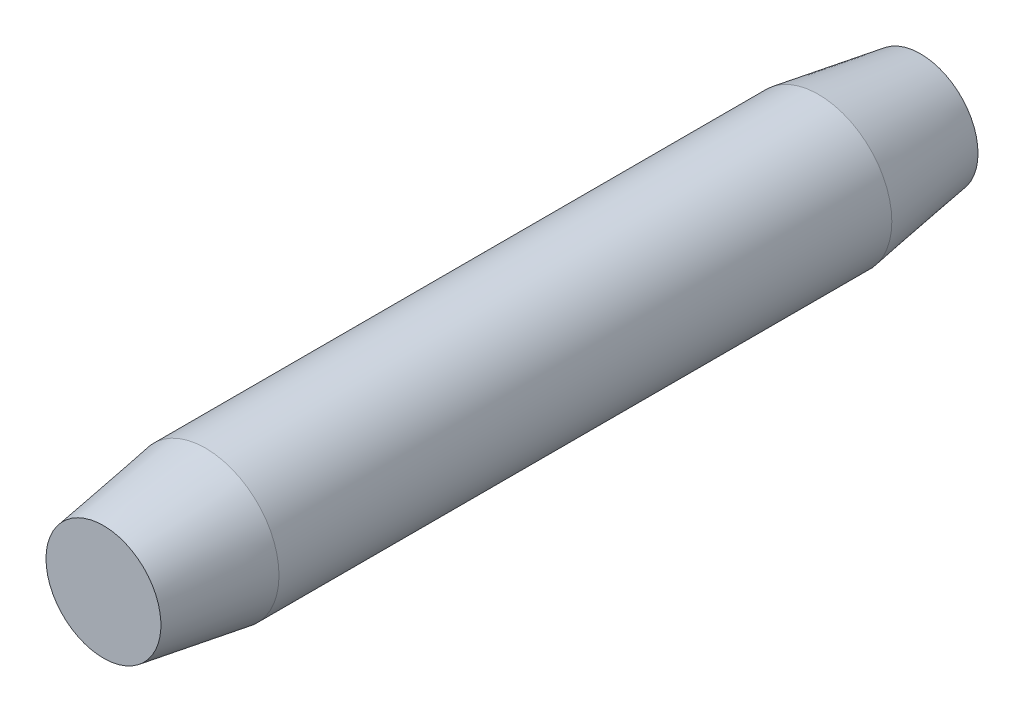
ISO-10303-21;
HEADER;
FILE_DESCRIPTION(('STEP AP214'),'2;1');
FILE_NAME('part.step','',(''),(''),'','','');
FILE_SCHEMA(('AUTOMOTIVE_DESIGN { 1 0 10303 214 1 1 1 1 }'));
ENDSEC;
DATA;
#1=APPLICATION_CONTEXT('core data for automotive mechanical design processes');
#2=APPLICATION_PROTOCOL_DEFINITION('international standard','automotive_design',2000,#1);
#3=PRODUCT_CONTEXT('',#1,'mechanical');
#4=PRODUCT('Part','Part','',(#3));
#5=PRODUCT_RELATED_PRODUCT_CATEGORY('part','',(#4));
#6=PRODUCT_DEFINITION_FORMATION('','',#4);
#7=PRODUCT_DEFINITION_CONTEXT('part definition',#1,'design');
#8=PRODUCT_DEFINITION('design','',#6,#7);
#9=PRODUCT_DEFINITION_SHAPE('','',#8);
#10=(LENGTH_UNIT() NAMED_UNIT(*) SI_UNIT(.MILLI.,.METRE.));
#11=(NAMED_UNIT(*) PLANE_ANGLE_UNIT() SI_UNIT($,.RADIAN.));
#12=(NAMED_UNIT(*) SI_UNIT($,.STERADIAN.) SOLID_ANGLE_UNIT());
#13=UNCERTAINTY_MEASURE_WITH_UNIT(LENGTH_MEASURE(1.E-05),#10,'distance_accuracy_value','');
#14=(GEOMETRIC_REPRESENTATION_CONTEXT(3) GLOBAL_UNCERTAINTY_ASSIGNED_CONTEXT((#13)) GLOBAL_UNIT_ASSIGNED_CONTEXT((#10,
#11,#12)) REPRESENTATION_CONTEXT('',''));
#15=CARTESIAN_POINT('',(0.,0.,0.));
#16=DIRECTION('',(0.,0.,1.));
#17=DIRECTION('',(1.,0.,0.));
#18=AXIS2_PLACEMENT_3D('',#15,#16,#17);
#19=CARTESIAN_POINT('',(-4.83870960531696,12.5960053959194,203.2));
#20=DIRECTION('',(0.,0.,-1.));
#21=DIRECTION('',(-1.,0.,0.));
#22=AXIS2_PLACEMENT_3D('',#19,#20,#21);
#23=PLANE('',#22);
#24=CARTESIAN_POINT('',(-4.83870960531696,12.5960053959194,203.199999999998));
#25=DIRECTION('',(0.,0.,-1.));
#26=DIRECTION('',(-1.,0.,0.));
#27=AXIS2_PLACEMENT_3D('',#24,#25,#26);
#28=CIRCLE('',#27,14.2874999999872);
#29=CARTESIAN_POINT('',(-19.1262096053042,12.5960053959194,203.199999999998));
#30=VERTEX_POINT('',#29);
#31=EDGE_CURVE('E18',#30,#30,#28,.T.);
#32=ORIENTED_EDGE('',*,*,#31,.F.);
#33=EDGE_LOOP('',(#32));
#34=FACE_BOUND('',#33,.T.);
#35=ADVANCED_FACE('F15',(#34),#23,.F.);
#36=CARTESIAN_POINT('',(-4.83870960531696,12.5960053959194,0.));
#37=DIRECTION('',(0.,0.,-1.));
#38=DIRECTION('',(-1.,0.,0.));
#39=AXIS2_PLACEMENT_3D('',#36,#37,#38);
#40=PLANE('',#39);
#41=CARTESIAN_POINT('',(-4.83870960531696,12.5960053959194,2.00880978518114E-12));
#42=DIRECTION('',(0.,0.,1.));
#43=DIRECTION('',(1.,0.,0.));
#44=AXIS2_PLACEMENT_3D('',#41,#42,#43);
#45=CIRCLE('',#44,14.2874999999872);
#46=CARTESIAN_POINT('',(9.44879039467024,12.5960053959194,2.00880978518114E-12));
#47=VERTEX_POINT('',#46);
#48=EDGE_CURVE('E27',#47,#47,#45,.T.);
#49=ORIENTED_EDGE('',*,*,#48,.F.);
#50=EDGE_LOOP('',(#49));
#51=FACE_BOUND('',#50,.T.);
#52=ADVANCED_FACE('F43',(#51),#40,.T.);
#53=CARTESIAN_POINT('',(-4.83870960531696,12.5960053959194,177.8));
#54=DIRECTION('',(0.,0.,-1.));
#55=DIRECTION('',(-1.,0.,0.));
#56=AXIS2_PLACEMENT_3D('',#53,#54,#55);
#57=CONICAL_SURFACE('',#56,18.25625,0.154996741924445);
#58=ORIENTED_EDGE('',*,*,#31,.T.);
#59=EDGE_LOOP('',(#58));
#60=FACE_BOUND('',#59,.T.);
#61=CARTESIAN_POINT('',(-4.83870960531696,12.5960053959194,177.8));
#62=DIRECTION('',(0.,0.,1.));
#63=DIRECTION('',(1.,0.,0.));
#64=AXIS2_PLACEMENT_3D('',#61,#62,#63);
#65=CIRCLE('',#64,18.25625);
#66=CARTESIAN_POINT('',(13.417540394683,12.5960053959194,177.8));
#67=VERTEX_POINT('',#66);
#68=EDGE_CURVE('E22',#67,#67,#65,.F.);
#69=ORIENTED_EDGE('',*,*,#68,.F.);
#70=EDGE_LOOP('',(#69));
#71=FACE_BOUND('',#70,.T.);
#72=ADVANCED_FACE('F39',(#60,#71),#57,.T.);
#73=CARTESIAN_POINT('',(-4.83870960531696,12.5960053959194,25.4));
#74=DIRECTION('',(0.,0.,1.));
#75=DIRECTION('',(1.,0.,0.));
#76=AXIS2_PLACEMENT_3D('',#73,#74,#75);
#77=CONICAL_SURFACE('',#76,18.25625,0.154996741924445);
#78=CARTESIAN_POINT('',(-4.83870960531696,12.5960053959194,25.4));
#79=DIRECTION('',(0.,0.,1.));
#80=DIRECTION('',(1.,0.,0.));
#81=AXIS2_PLACEMENT_3D('',#78,#79,#80);
#82=CIRCLE('',#81,18.25625);
#83=CARTESIAN_POINT('',(13.417540394683,12.5960053959194,25.4));
#84=VERTEX_POINT('',#83);
#85=EDGE_CURVE('E10',#84,#84,#82,.T.);
#86=ORIENTED_EDGE('',*,*,#85,.F.);
#87=EDGE_LOOP('',(#86));
#88=FACE_BOUND('',#87,.T.);
#89=ORIENTED_EDGE('',*,*,#48,.T.);
#90=EDGE_LOOP('',(#89));
#91=FACE_BOUND('',#90,.T.);
#92=ADVANCED_FACE('F51',(#88,#91),#77,.T.);
#93=CARTESIAN_POINT('',(-4.83870960531696,12.5960053959194,0.));
#94=DIRECTION('',(0.,0.,1.));
#95=DIRECTION('',(1.,0.,0.));
#96=AXIS2_PLACEMENT_3D('',#93,#94,#95);
#97=CYLINDRICAL_SURFACE('',#96,18.25625);
#98=ORIENTED_EDGE('',*,*,#85,.T.);
#99=EDGE_LOOP('',(#98));
#100=FACE_BOUND('',#99,.T.);
#101=ORIENTED_EDGE('',*,*,#68,.T.);
#102=EDGE_LOOP('',(#101));
#103=FACE_BOUND('',#102,.T.);
#104=ADVANCED_FACE('F49',(#100,#103),#97,.T.);
#105=CLOSED_SHELL('',(#35,#52,#72,#92,#104));
#106=MANIFOLD_SOLID_BREP('B1',#105);
#107=ADVANCED_BREP_SHAPE_REPRESENTATION('',(#18,#106),#14);
#108=SHAPE_DEFINITION_REPRESENTATION(#9,#107);
ENDSEC;
END-ISO-10303-21;
